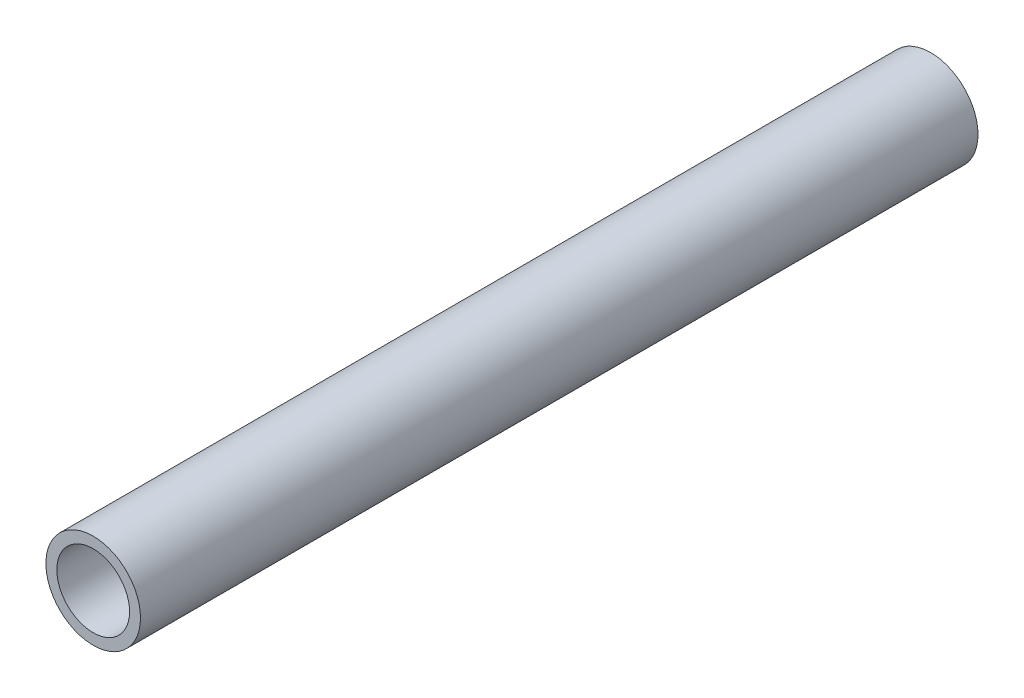
ISO-10303-21;
HEADER;
FILE_DESCRIPTION(('STEP AP214'),'2;1');
FILE_NAME('part.step','',(''),(''),'','','');
FILE_SCHEMA(('AUTOMOTIVE_DESIGN { 1 0 10303 214 1 1 1 1 }'));
ENDSEC;
DATA;
#1=APPLICATION_CONTEXT('core data for automotive mechanical design processes');
#2=APPLICATION_PROTOCOL_DEFINITION('international standard','automotive_design',2000,#1);
#3=PRODUCT_CONTEXT('',#1,'mechanical');
#4=PRODUCT('Part','Part','',(#3));
#5=PRODUCT_RELATED_PRODUCT_CATEGORY('part','',(#4));
#6=PRODUCT_DEFINITION_FORMATION('','',#4);
#7=PRODUCT_DEFINITION_CONTEXT('part definition',#1,'design');
#8=PRODUCT_DEFINITION('design','',#6,#7);
#9=PRODUCT_DEFINITION_SHAPE('','',#8);
#10=(LENGTH_UNIT() NAMED_UNIT(*) SI_UNIT(.MILLI.,.METRE.));
#11=(NAMED_UNIT(*) PLANE_ANGLE_UNIT() SI_UNIT($,.RADIAN.));
#12=(NAMED_UNIT(*) SI_UNIT($,.STERADIAN.) SOLID_ANGLE_UNIT());
#13=UNCERTAINTY_MEASURE_WITH_UNIT(LENGTH_MEASURE(1.E-05),#10,'distance_accuracy_value','');
#14=(GEOMETRIC_REPRESENTATION_CONTEXT(3) GLOBAL_UNCERTAINTY_ASSIGNED_CONTEXT((#13)) GLOBAL_UNIT_ASSIGNED_CONTEXT((#10,
#11,#12)) REPRESENTATION_CONTEXT('',''));
#15=CARTESIAN_POINT('',(0.,0.,0.));
#16=DIRECTION('',(0.,0.,1.));
#17=DIRECTION('',(1.,0.,0.));
#18=AXIS2_PLACEMENT_3D('',#15,#16,#17);
#19=CARTESIAN_POINT('',(0.,0.,0.));
#20=DIRECTION('',(0.,0.,1.));
#21=DIRECTION('',(1.,0.,0.));
#22=AXIS2_PLACEMENT_3D('',#19,#20,#21);
#23=CYLINDRICAL_SURFACE('',#22,4.826);
#24=CARTESIAN_POINT('',(0.,0.,0.));
#25=DIRECTION('',(0.,0.,1.));
#26=DIRECTION('',(1.,0.,0.));
#27=AXIS2_PLACEMENT_3D('',#24,#25,#26);
#28=CIRCLE('',#27,4.826);
#29=CARTESIAN_POINT('',(4.826,0.,0.));
#30=VERTEX_POINT('',#29);
#31=EDGE_CURVE('E27',#30,#30,#28,.T.);
#32=ORIENTED_EDGE('',*,*,#31,.F.);
#33=EDGE_LOOP('',(#32));
#34=FACE_BOUND('',#33,.T.);
#35=CARTESIAN_POINT('',(0.,0.,111.125));
#36=DIRECTION('',(0.,0.,1.));
#37=DIRECTION('',(1.,0.,0.));
#38=AXIS2_PLACEMENT_3D('',#35,#36,#37);
#39=CIRCLE('',#38,4.826);
#40=CARTESIAN_POINT('',(4.826,0.,111.125));
#41=VERTEX_POINT('',#40);
#42=EDGE_CURVE('E18',#41,#41,#39,.T.);
#43=ORIENTED_EDGE('',*,*,#42,.T.);
#44=EDGE_LOOP('',(#43));
#45=FACE_BOUND('',#44,.T.);
#46=ADVANCED_FACE('F15',(#34,#45),#23,.F.);
#47=CARTESIAN_POINT('',(0.,0.,111.125));
#48=DIRECTION('',(0.,0.,-1.));
#49=DIRECTION('',(-1.,0.,0.));
#50=AXIS2_PLACEMENT_3D('',#47,#48,#49);
#51=PLANE('',#50);
#52=ORIENTED_EDGE('',*,*,#42,.F.);
#53=EDGE_LOOP('',(#52));
#54=FACE_BOUND('',#53,.T.);
#55=CARTESIAN_POINT('',(0.,0.,111.125));
#56=DIRECTION('',(0.,0.,1.));
#57=DIRECTION('',(1.,0.,0.));
#58=AXIS2_PLACEMENT_3D('',#55,#56,#57);
#59=CIRCLE('',#58,6.2738);
#60=CARTESIAN_POINT('',(6.2738,0.,111.125));
#61=VERTEX_POINT('',#60);
#62=EDGE_CURVE('E22',#61,#61,#59,.F.);
#63=ORIENTED_EDGE('',*,*,#62,.F.);
#64=EDGE_LOOP('',(#63));
#65=FACE_BOUND('',#64,.T.);
#66=ADVANCED_FACE('F36',(#54,#65),#51,.F.);
#67=CARTESIAN_POINT('',(0.,0.,0.));
#68=DIRECTION('',(0.,0.,-1.));
#69=DIRECTION('',(-1.,0.,0.));
#70=AXIS2_PLACEMENT_3D('',#67,#68,#69);
#71=PLANE('',#70);
#72=ORIENTED_EDGE('',*,*,#31,.T.);
#73=EDGE_LOOP('',(#72));
#74=FACE_BOUND('',#73,.T.);
#75=CARTESIAN_POINT('',(0.,0.,0.));
#76=DIRECTION('',(0.,0.,1.));
#77=DIRECTION('',(1.,0.,0.));
#78=AXIS2_PLACEMENT_3D('',#75,#76,#77);
#79=CIRCLE('',#78,6.2738);
#80=CARTESIAN_POINT('',(6.2738,0.,0.));
#81=VERTEX_POINT('',#80);
#82=EDGE_CURVE('E10',#81,#81,#79,.T.);
#83=ORIENTED_EDGE('',*,*,#82,.F.);
#84=EDGE_LOOP('',(#83));
#85=FACE_BOUND('',#84,.T.);
#86=ADVANCED_FACE('F39',(#74,#85),#71,.T.);
#87=CARTESIAN_POINT('',(0.,0.,0.));
#88=DIRECTION('',(0.,0.,1.));
#89=DIRECTION('',(1.,0.,0.));
#90=AXIS2_PLACEMENT_3D('',#87,#88,#89);
#91=CYLINDRICAL_SURFACE('',#90,6.2738);
#92=ORIENTED_EDGE('',*,*,#82,.T.);
#93=EDGE_LOOP('',(#92));
#94=FACE_BOUND('',#93,.T.);
#95=ORIENTED_EDGE('',*,*,#62,.T.);
#96=EDGE_LOOP('',(#95));
#97=FACE_BOUND('',#96,.T.);
#98=ADVANCED_FACE('F42',(#94,#97),#91,.T.);
#99=CLOSED_SHELL('',(#46,#66,#86,#98));
#100=MANIFOLD_SOLID_BREP('B1',#99);
#101=ADVANCED_BREP_SHAPE_REPRESENTATION('',(#18,#100),#14);
#102=SHAPE_DEFINITION_REPRESENTATION(#9,#101);
ENDSEC;
END-ISO-10303-21;
